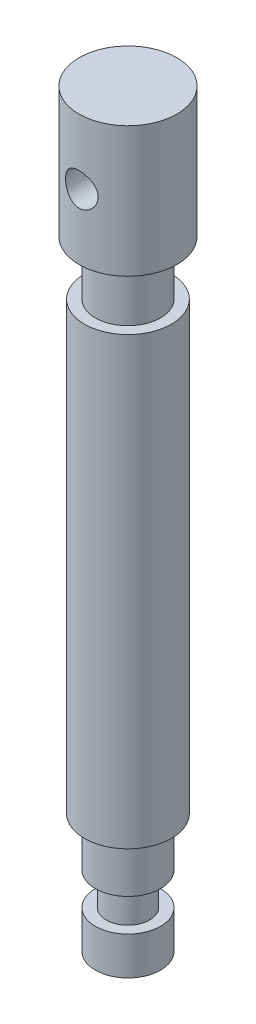
ISO-10303-21;
HEADER;
FILE_DESCRIPTION(('STEP AP214'),'2;1');
FILE_NAME('part.step','',(''),(''),'','','');
FILE_SCHEMA(('AUTOMOTIVE_DESIGN { 1 0 10303 214 1 1 1 1 }'));
ENDSEC;
DATA;
#1=APPLICATION_CONTEXT('core data for automotive mechanical design processes');
#2=APPLICATION_PROTOCOL_DEFINITION('international standard','automotive_design',2000,#1);
#3=PRODUCT_CONTEXT('',#1,'mechanical');
#4=PRODUCT('Part','Part','',(#3));
#5=PRODUCT_RELATED_PRODUCT_CATEGORY('part','',(#4));
#6=PRODUCT_DEFINITION_FORMATION('','',#4);
#7=PRODUCT_DEFINITION_CONTEXT('part definition',#1,'design');
#8=PRODUCT_DEFINITION('design','',#6,#7);
#9=PRODUCT_DEFINITION_SHAPE('','',#8);
#10=(LENGTH_UNIT() NAMED_UNIT(*) SI_UNIT(.MILLI.,.METRE.));
#11=(NAMED_UNIT(*) PLANE_ANGLE_UNIT() SI_UNIT($,.RADIAN.));
#12=(NAMED_UNIT(*) SI_UNIT($,.STERADIAN.) SOLID_ANGLE_UNIT());
#13=UNCERTAINTY_MEASURE_WITH_UNIT(LENGTH_MEASURE(1.E-05),#10,'distance_accuracy_value','');
#14=(GEOMETRIC_REPRESENTATION_CONTEXT(3) GLOBAL_UNCERTAINTY_ASSIGNED_CONTEXT((#13)) GLOBAL_UNIT_ASSIGNED_CONTEXT((#10,
#11,#12)) REPRESENTATION_CONTEXT('',''));
#15=CARTESIAN_POINT('',(0.,0.,0.));
#16=DIRECTION('',(0.,0.,1.));
#17=DIRECTION('',(1.,0.,0.));
#18=AXIS2_PLACEMENT_3D('',#15,#16,#17);
#19=CARTESIAN_POINT('',(0.,0.,0.));
#20=DIRECTION('',(0.,1.,0.));
#21=DIRECTION('',(-1.,0.,0.));
#22=AXIS2_PLACEMENT_3D('',#19,#20,#21);
#23=PLANE('',#22);
#24=CARTESIAN_POINT('',(0.,0.,0.));
#25=DIRECTION('',(0.,1.,0.));
#26=DIRECTION('',(-1.,0.,0.));
#27=AXIS2_PLACEMENT_3D('',#24,#25,#26);
#28=CIRCLE('',#27,6.);
#29=CARTESIAN_POINT('',(-6.,0.,0.));
#30=VERTEX_POINT('',#29);
#31=EDGE_CURVE('E57',#30,#30,#28,.T.);
#32=ORIENTED_EDGE('',*,*,#31,.F.);
#33=EDGE_LOOP('',(#32));
#34=FACE_BOUND('',#33,.T.);
#35=ADVANCED_FACE('F42',(#34),#23,.F.);
#36=CARTESIAN_POINT('',(0.,138.,0.));
#37=DIRECTION('',(0.,1.,0.));
#38=DIRECTION('',(-1.,0.,0.));
#39=AXIS2_PLACEMENT_3D('',#36,#37,#38);
#40=CYLINDRICAL_SURFACE('',#39,6.);
#41=CARTESIAN_POINT('',(0.,7.00000000000001,0.));
#42=DIRECTION('',(0.,1.,0.));
#43=DIRECTION('',(-1.,0.,0.));
#44=AXIS2_PLACEMENT_3D('',#41,#42,#43);
#45=CIRCLE('',#44,6.);
#46=CARTESIAN_POINT('',(-6.,7.00000000000001,0.));
#47=VERTEX_POINT('',#46);
#48=EDGE_CURVE('E61',#47,#47,#45,.T.);
#49=ORIENTED_EDGE('',*,*,#48,.F.);
#50=EDGE_LOOP('',(#49));
#51=FACE_BOUND('',#50,.T.);
#52=ORIENTED_EDGE('',*,*,#31,.T.);
#53=EDGE_LOOP('',(#52));
#54=FACE_BOUND('',#53,.T.);
#55=ADVANCED_FACE('F85',(#51,#54),#40,.T.);
#56=CARTESIAN_POINT('',(6.,7.,0.));
#57=DIRECTION('',(0.,-1.,0.));
#58=DIRECTION('',(1.,0.,0.));
#59=AXIS2_PLACEMENT_3D('',#56,#57,#58);
#60=PLANE('',#59);
#61=CARTESIAN_POINT('',(0.,7.00000000000001,0.));
#62=DIRECTION('',(0.,1.,0.));
#63=DIRECTION('',(-1.,0.,0.));
#64=AXIS2_PLACEMENT_3D('',#61,#62,#63);
#65=CIRCLE('',#64,4.00000000000002);
#66=CARTESIAN_POINT('',(-4.00000000000002,7.00000000000001,0.));
#67=VERTEX_POINT('',#66);
#68=EDGE_CURVE('E162',#67,#67,#65,.T.);
#69=ORIENTED_EDGE('',*,*,#68,.F.);
#70=EDGE_LOOP('',(#69));
#71=FACE_BOUND('',#70,.T.);
#72=ORIENTED_EDGE('',*,*,#48,.T.);
#73=EDGE_LOOP('',(#72));
#74=FACE_BOUND('',#73,.T.);
#75=ADVANCED_FACE('F90',(#71,#74),#60,.F.);
#76=CARTESIAN_POINT('',(0.,138.,0.));
#77=DIRECTION('',(0.,1.,0.));
#78=DIRECTION('',(-1.,0.,0.));
#79=AXIS2_PLACEMENT_3D('',#76,#77,#78);
#80=CYLINDRICAL_SURFACE('',#79,4.00000000000002);
#81=CARTESIAN_POINT('',(0.,13.,0.));
#82=DIRECTION('',(0.,1.,0.));
#83=DIRECTION('',(-1.,0.,0.));
#84=AXIS2_PLACEMENT_3D('',#81,#82,#83);
#85=CIRCLE('',#84,4.00000000000002);
#86=CARTESIAN_POINT('',(-4.00000000000002,13.,0.));
#87=VERTEX_POINT('',#86);
#88=EDGE_CURVE('E159',#87,#87,#85,.T.);
#89=ORIENTED_EDGE('',*,*,#88,.F.);
#90=EDGE_LOOP('',(#89));
#91=FACE_BOUND('',#90,.T.);
#92=ORIENTED_EDGE('',*,*,#68,.T.);
#93=EDGE_LOOP('',(#92));
#94=FACE_BOUND('',#93,.T.);
#95=ADVANCED_FACE('F97',(#91,#94),#80,.T.);
#96=CARTESIAN_POINT('',(4.00000000000002,13.,0.));
#97=DIRECTION('',(0.,1.,0.));
#98=DIRECTION('',(-1.,0.,0.));
#99=AXIS2_PLACEMENT_3D('',#96,#97,#98);
#100=PLANE('',#99);
#101=CARTESIAN_POINT('',(0.,13.,0.));
#102=DIRECTION('',(0.,1.,0.));
#103=DIRECTION('',(-1.,0.,0.));
#104=AXIS2_PLACEMENT_3D('',#101,#102,#103);
#105=CIRCLE('',#104,6.00000000000002);
#106=CARTESIAN_POINT('',(-6.00000000000002,13.,0.));
#107=VERTEX_POINT('',#106);
#108=EDGE_CURVE('E156',#107,#107,#105,.T.);
#109=ORIENTED_EDGE('',*,*,#108,.F.);
#110=EDGE_LOOP('',(#109));
#111=FACE_BOUND('',#110,.T.);
#112=ORIENTED_EDGE('',*,*,#88,.T.);
#113=EDGE_LOOP('',(#112));
#114=FACE_BOUND('',#113,.T.);
#115=ADVANCED_FACE('F104',(#111,#114),#100,.F.);
#116=CARTESIAN_POINT('',(0.,138.,0.));
#117=DIRECTION('',(0.,1.,0.));
#118=DIRECTION('',(-1.,0.,0.));
#119=AXIS2_PLACEMENT_3D('',#116,#117,#118);
#120=CYLINDRICAL_SURFACE('',#119,6.00000000000002);
#121=CARTESIAN_POINT('',(0.,22.,0.));
#122=DIRECTION('',(0.,1.,0.));
#123=DIRECTION('',(-1.,0.,0.));
#124=AXIS2_PLACEMENT_3D('',#121,#122,#123);
#125=CIRCLE('',#124,6.00000000000002);
#126=CARTESIAN_POINT('',(-6.00000000000002,22.,0.));
#127=VERTEX_POINT('',#126);
#128=EDGE_CURVE('E153',#127,#127,#125,.T.);
#129=ORIENTED_EDGE('',*,*,#128,.F.);
#130=EDGE_LOOP('',(#129));
#131=FACE_BOUND('',#130,.T.);
#132=ORIENTED_EDGE('',*,*,#108,.T.);
#133=EDGE_LOOP('',(#132));
#134=FACE_BOUND('',#133,.T.);
#135=ADVANCED_FACE('F108',(#131,#134),#120,.T.);
#136=CARTESIAN_POINT('',(6.00000000000002,22.,0.));
#137=DIRECTION('',(0.,1.,0.));
#138=DIRECTION('',(-1.,0.,0.));
#139=AXIS2_PLACEMENT_3D('',#136,#137,#138);
#140=PLANE('',#139);
#141=CARTESIAN_POINT('',(0.,22.,0.));
#142=DIRECTION('',(0.,1.,0.));
#143=DIRECTION('',(-1.,0.,0.));
#144=AXIS2_PLACEMENT_3D('',#141,#142,#143);
#145=CIRCLE('',#144,8.00000000000001);
#146=CARTESIAN_POINT('',(-8.00000000000002,22.,0.));
#147=VERTEX_POINT('',#146);
#148=EDGE_CURVE('E150',#147,#147,#145,.T.);
#149=ORIENTED_EDGE('',*,*,#148,.F.);
#150=EDGE_LOOP('',(#149));
#151=FACE_BOUND('',#150,.T.);
#152=ORIENTED_EDGE('',*,*,#128,.T.);
#153=EDGE_LOOP('',(#152));
#154=FACE_BOUND('',#153,.T.);
#155=ADVANCED_FACE('F112',(#151,#154),#140,.F.);
#156=CARTESIAN_POINT('',(0.,138.,0.));
#157=DIRECTION('',(0.,1.,0.));
#158=DIRECTION('',(-1.,0.,0.));
#159=AXIS2_PLACEMENT_3D('',#156,#157,#158);
#160=CYLINDRICAL_SURFACE('',#159,8.00000000000002);
#161=CARTESIAN_POINT('',(0.,104.,0.));
#162=DIRECTION('',(0.,1.,0.));
#163=DIRECTION('',(-1.,0.,0.));
#164=AXIS2_PLACEMENT_3D('',#161,#162,#163);
#165=CIRCLE('',#164,8.00000000000002);
#166=CARTESIAN_POINT('',(-8.00000000000003,104.,0.));
#167=VERTEX_POINT('',#166);
#168=EDGE_CURVE('E142',#167,#167,#165,.T.);
#169=ORIENTED_EDGE('',*,*,#168,.F.);
#170=EDGE_LOOP('',(#169));
#171=FACE_BOUND('',#170,.T.);
#172=ORIENTED_EDGE('',*,*,#148,.T.);
#173=EDGE_LOOP('',(#172));
#174=FACE_BOUND('',#173,.T.);
#175=ADVANCED_FACE('F116',(#171,#174),#160,.T.);
#176=CARTESIAN_POINT('',(8.00000000000001,104.,0.));
#177=DIRECTION('',(0.,-1.,0.));
#178=DIRECTION('',(1.,0.,0.));
#179=AXIS2_PLACEMENT_3D('',#176,#177,#178);
#180=PLANE('',#179);
#181=CARTESIAN_POINT('',(0.,104.,0.));
#182=DIRECTION('',(0.,1.,0.));
#183=DIRECTION('',(-1.,0.,0.));
#184=AXIS2_PLACEMENT_3D('',#181,#182,#183);
#185=CIRCLE('',#184,6.00000000000002);
#186=CARTESIAN_POINT('',(-6.00000000000002,104.,0.));
#187=VERTEX_POINT('',#186);
#188=EDGE_CURVE('E139',#187,#187,#185,.T.);
#189=ORIENTED_EDGE('',*,*,#188,.F.);
#190=EDGE_LOOP('',(#189));
#191=FACE_BOUND('',#190,.T.);
#192=ORIENTED_EDGE('',*,*,#168,.T.);
#193=EDGE_LOOP('',(#192));
#194=FACE_BOUND('',#193,.T.);
#195=ADVANCED_FACE('F120',(#191,#194),#180,.F.);
#196=CARTESIAN_POINT('',(0.,138.,0.));
#197=DIRECTION('',(0.,1.,0.));
#198=DIRECTION('',(-1.,0.,0.));
#199=AXIS2_PLACEMENT_3D('',#196,#197,#198);
#200=CYLINDRICAL_SURFACE('',#199,6.00000000000002);
#201=CARTESIAN_POINT('',(0.,114.,0.));
#202=DIRECTION('',(0.,1.,0.));
#203=DIRECTION('',(-1.,0.,0.));
#204=AXIS2_PLACEMENT_3D('',#201,#202,#203);
#205=CIRCLE('',#204,6.00000000000002);
#206=CARTESIAN_POINT('',(-6.00000000000002,114.,0.));
#207=VERTEX_POINT('',#206);
#208=EDGE_CURVE('E138',#207,#207,#205,.T.);
#209=ORIENTED_EDGE('',*,*,#208,.F.);
#210=EDGE_LOOP('',(#209));
#211=FACE_BOUND('',#210,.T.);
#212=ORIENTED_EDGE('',*,*,#188,.T.);
#213=EDGE_LOOP('',(#212));
#214=FACE_BOUND('',#213,.T.);
#215=ADVANCED_FACE('F124',(#211,#214),#200,.T.);
#216=CARTESIAN_POINT('',(6.00000000000001,114.,0.));
#217=DIRECTION('',(0.,1.,0.));
#218=DIRECTION('',(-1.,0.,0.));
#219=AXIS2_PLACEMENT_3D('',#216,#217,#218);
#220=PLANE('',#219);
#221=CARTESIAN_POINT('',(0.,114.,0.));
#222=DIRECTION('',(0.,1.,0.));
#223=DIRECTION('',(-1.,0.,0.));
#224=AXIS2_PLACEMENT_3D('',#221,#222,#223);
#225=CIRCLE('',#224,9.00000000000002);
#226=CARTESIAN_POINT('',(-9.00000000000002,114.,0.));
#227=VERTEX_POINT('',#226);
#228=EDGE_CURVE('E135',#227,#227,#225,.T.);
#229=ORIENTED_EDGE('',*,*,#228,.F.);
#230=EDGE_LOOP('',(#229));
#231=FACE_BOUND('',#230,.T.);
#232=ORIENTED_EDGE('',*,*,#208,.T.);
#233=EDGE_LOOP('',(#232));
#234=FACE_BOUND('',#233,.T.);
#235=ADVANCED_FACE('F82',(#231,#234),#220,.F.);
#236=CARTESIAN_POINT('',(0.,138.,0.));
#237=DIRECTION('',(0.,1.,0.));
#238=DIRECTION('',(-1.,0.,0.));
#239=AXIS2_PLACEMENT_3D('',#236,#237,#238);
#240=CYLINDRICAL_SURFACE('',#239,9.00000000000001);
#241=CARTESIAN_POINT('',(0.,129.,-9.00000000000002));
#242=CARTESIAN_POINT('',(-0.163690088660177,129.000000761195,-9.00000045902834));
#243=CARTESIAN_POINT('',(-0.327375583615656,128.986559201618,-8.99549308522636));
#244=CARTESIAN_POINT('',(-0.649925282618924,128.933312673548,-8.97795630609843));
#245=CARTESIAN_POINT('',(-0.808788984356462,128.893504968153,-8.96492601606459));
#246=CARTESIAN_POINT('',(-1.11699836850534,128.789042269848,-8.93175923719329));
#247=CARTESIAN_POINT('',(-1.26635947765811,128.724428812622,-8.91163463192561));
#248=CARTESIAN_POINT('',(-1.55212481041599,128.572376481485,-8.86633337152027));
#249=CARTESIAN_POINT('',(-1.68852647087613,128.484933104992,-8.84115572003335));
#250=CARTESIAN_POINT('',(-1.94922502506681,128.286522585424,-8.78742283329016));
#251=CARTESIAN_POINT('',(-2.07301110089493,128.174906297219,-8.75878669391356));
#252=CARTESIAN_POINT('',(-2.30049807810625,127.93269853588,-8.70180944349366));
#253=CARTESIAN_POINT('',(-2.40419455646839,127.802102895214,-8.67346839871649));
#254=CARTESIAN_POINT('',(-2.59147482668359,127.521044654411,-8.61939997431823));
#255=CARTESIAN_POINT('',(-2.67439457466311,127.370118780804,-8.59377117827066));
#256=CARTESIAN_POINT('',(-2.81345662163317,127.055471716624,-8.54925916255805));
#257=CARTESIAN_POINT('',(-2.86960709216029,126.891754448512,-8.53037388482238));
#258=CARTESIAN_POINT('',(-2.95162038452749,126.56198033551,-8.50233909808133));
#259=CARTESIAN_POINT('',(-2.97844034481531,126.396188374533,-8.49288287308835));
#260=CARTESIAN_POINT('',(-3.00402337000343,126.062208737532,-8.48386969888524));
#261=CARTESIAN_POINT('',(-3.00279510481416,125.894021817872,-8.48430969068191));
#262=CARTESIAN_POINT('',(-2.97305971111026,125.568190108668,-8.49477045024542));
#263=CARTESIAN_POINT('',(-2.94580173950098,125.410414791243,-8.50435247602601));
#264=CARTESIAN_POINT('',(-2.86681848854825,125.101819741179,-8.53129973173655));
#265=CARTESIAN_POINT('',(-2.81509027977561,124.951000843695,-8.54866589352324));
#266=CARTESIAN_POINT('',(-2.68781717418062,124.657761751226,-8.58953733393748));
#267=CARTESIAN_POINT('',(-2.61190214612178,124.515515923591,-8.61313697379354));
#268=CARTESIAN_POINT('',(-2.43866731890941,124.245387275161,-8.66377675727181));
#269=CARTESIAN_POINT('',(-2.341341337092,124.1175086192,-8.69081789371393));
#270=CARTESIAN_POINT('',(-2.1220479980467,123.872725205518,-8.74701987503224));
#271=CARTESIAN_POINT('',(-1.99905945022892,123.756741916473,-8.7762176806453));
#272=CARTESIAN_POINT('',(-1.73501870991018,123.54680620001,-8.83220815161112));
#273=CARTESIAN_POINT('',(-1.59396478698243,123.452855885507,-8.85900058614204));
#274=CARTESIAN_POINT('',(-1.29584283913879,123.288911099295,-8.90751323813382));
#275=CARTESIAN_POINT('',(-1.138629829249,123.219163525978,-8.92918050024119));
#276=CARTESIAN_POINT('',(-0.813807250093514,123.107390478133,-8.96461701433306));
#277=CARTESIAN_POINT('',(-0.646201314464852,123.06535537373,-8.97838900964639));
#278=CARTESIAN_POINT('',(-0.313151488587901,123.011833001933,-8.99602881214323));
#279=CARTESIAN_POINT('',(-0.147928799594527,122.999100572482,-9.00030005501186));
#280=CARTESIAN_POINT('',(0.182325209880726,123.000998020795,-8.99966708084484));
#281=CARTESIAN_POINT('',(0.347356557958965,123.01562327994,-8.99476441258088));
#282=CARTESIAN_POINT('',(0.667559598912782,123.070835723208,-8.97660074151314));
#283=CARTESIAN_POINT('',(0.822878420504546,123.110658618148,-8.96358596133578));
#284=CARTESIAN_POINT('',(1.12456787573873,123.2141803334,-8.93075540490211));
#285=CARTESIAN_POINT('',(1.27093736552583,123.277882198403,-8.91093876140026));
#286=CARTESIAN_POINT('',(1.55486488917983,123.429211295522,-8.8658679386187));
#287=CARTESIAN_POINT('',(1.69208987765146,123.51742377985,-8.84048444267359));
#288=CARTESIAN_POINT('',(1.95019449040678,123.71458245004,-8.78715761748788));
#289=CARTESIAN_POINT('',(2.07106910338674,123.823534968095,-8.75921350781484));
#290=CARTESIAN_POINT('',(2.29875752341891,124.06493625302,-8.70230543941335));
#291=CARTESIAN_POINT('',(2.40468290773732,124.198227680781,-8.67335283262284));
#292=CARTESIAN_POINT('',(2.59277256697073,124.481314703433,-8.61899919884127));
#293=CARTESIAN_POINT('',(2.67493664379305,124.631110435902,-8.59359820146008));
#294=CARTESIAN_POINT('',(2.81279079124909,124.94301904587,-8.54947175374151));
#295=CARTESIAN_POINT('',(2.86853439649507,125.105106237506,-8.53073282378937));
#296=CARTESIAN_POINT('',(2.95168400027807,125.437135950132,-8.5023249691935));
#297=CARTESIAN_POINT('',(2.97910276486182,125.607074896213,-8.49265195870919));
#298=CARTESIAN_POINT('',(3.00382884743203,125.940591288123,-8.48393576622533));
#299=CARTESIAN_POINT('',(3.0026107719252,126.10404702086,-8.48437200772246));
#300=CARTESIAN_POINT('',(2.97372688034608,126.428295224766,-8.49453809471603));
#301=CARTESIAN_POINT('',(2.94606263837576,126.589087853865,-8.50426738708086));
#302=CARTESIAN_POINT('',(2.86611543938803,126.900406989007,-8.53153572914676));
#303=CARTESIAN_POINT('',(2.81431003804653,127.051070475014,-8.54892294067434));
#304=CARTESIAN_POINT('',(2.68793809727923,127.341682220815,-8.58949196455407));
#305=CARTESIAN_POINT('',(2.61336650566141,127.481628093564,-8.61267506290181));
#306=CARTESIAN_POINT('',(2.43978207775028,127.753451009769,-8.6634848767814));
#307=CARTESIAN_POINT('',(2.33984472829374,127.884709505695,-8.69126134926412));
#308=CARTESIAN_POINT('',(2.11992864940694,128.129069440153,-8.7475006884976));
#309=CARTESIAN_POINT('',(1.99994425335444,128.242165727064,-8.77596374737118));
#310=CARTESIAN_POINT('',(1.73772467076207,128.451433236868,-8.83170091576634));
#311=CARTESIAN_POINT('',(1.59480454049919,128.546773043253,-8.85888545403771));
#312=CARTESIAN_POINT('',(1.29407207221987,128.711971286552,-8.90777973517837));
#313=CARTESIAN_POINT('',(1.13626355439704,128.781836237766,-8.92949087723791));
#314=CARTESIAN_POINT('',(0.817480941602916,128.891164897466,-8.96416545205627));
#315=CARTESIAN_POINT('',(0.656963273029217,128.93184739879,-8.97747637267569));
#316=CARTESIAN_POINT('',(0.330961248030734,128.986260842031,-8.99539221192667));
#317=CARTESIAN_POINT('',(0.165478276706231,128.99999923049,-8.99999953595716));
#318=CARTESIAN_POINT('',(0.,129.,-9.00000000000002));
#319=B_SPLINE_CURVE_WITH_KNOTS('',3,(#241,#242,#243,#244,#245,#246,#247,#248,#249,#250,#251,
#252,#253,#254,#255,#256,#257,#258,#259,#260,#261,#262,#263,#264,#265,#266,#267,#268,#269,#270,
#271,#272,#273,#274,#275,#276,#277,#278,#279,#280,#281,#282,#283,#284,#285,#286,#287,#288,#289,
#290,#291,#292,#293,#294,#295,#296,#297,#298,#299,#300,#301,#302,#303,#304,#305,#306,#307,#308,
#309,#310,#311,#312,#313,#314,#315,#316,#317,#318),.UNSPECIFIED.,.T.,.F.,(4,2,2,2,2,2,2,2,2,2,2,
2,2,2,2,2,2,2,2,2,2,2,2,2,2,2,2,2,2,2,2,2,2,2,2,2,2,2,4),(0.,0.49046131807803,0.980973555802565,
1.47066801861083,1.96045913339732,2.46554052848268,2.97073299862591,3.49045154470411,
4.01001134078499,4.51205777225523,5.01394901962458,5.49290479653844,5.97191792566448,
6.45864513465394,6.94551307674623,7.45779917434102,7.97013437899856,8.48755216951073,
9.00479006631626,9.4996074952551,9.99434139492531,10.4747447393464,10.9552093585231,
11.4483119953121,11.9415654246567,12.4572306864226,12.9729002470499,13.4875204148031,
14.0019085411752,14.4898699819277,14.9778023805413,15.4564676124125,15.9352391452794,
16.4349020007541,16.9347063337134,17.453989825053,17.9731404345737,18.4690967512144,
18.9649159811442),.UNSPECIFIED.);
#320=CARTESIAN_POINT('',(0.,129.,-9.00000000000002));
#321=VERTEX_POINT('',#320);
#322=EDGE_CURVE('E12',#321,#321,#319,.T.);
#323=ORIENTED_EDGE('',*,*,#322,.T.);
#324=EDGE_LOOP('',(#323));
#325=FACE_BOUND('',#324,.T.);
#326=CARTESIAN_POINT('',(3.,126.,8.48528137423858));
#327=CARTESIAN_POINT('',(3.00000077384314,125.836595475492,8.48528083591303));
#328=CARTESIAN_POINT('',(2.98660435105657,125.673195600529,8.49005307872573));
#329=CARTESIAN_POINT('',(2.93355339506643,125.351236737017,8.50852722243765));
#330=CARTESIAN_POINT('',(2.8938945365052,125.192678550383,8.52223059426567));
#331=CARTESIAN_POINT('',(2.78986645705472,124.885119321008,8.55684611066376));
#332=CARTESIAN_POINT('',(2.72554566420974,124.736100211672,8.57774411913966));
#333=CARTESIAN_POINT('',(2.57418488532415,124.450919854356,8.62437366030975));
#334=CARTESIAN_POINT('',(2.48713988658056,124.314761452339,8.65010625910838));
#335=CARTESIAN_POINT('',(2.28915343932864,124.053840112985,8.7046346822242));
#336=CARTESIAN_POINT('',(2.17747302413377,123.929653713985,8.73350684533933));
#337=CARTESIAN_POINT('',(1.9349630016432,123.701379596326,8.7904159440301));
#338=CARTESIAN_POINT('',(1.80413032515714,123.597295105253,8.81845274486886));
#339=CARTESIAN_POINT('',(1.52281352389504,123.409563308011,8.87141600765398));
#340=CARTESIAN_POINT('',(1.37190573367359,123.326520088146,8.89624223104818));
#341=CARTESIAN_POINT('',(1.05729366896244,123.187225244617,8.9390876031295));
#342=CARTESIAN_POINT('',(0.893592857061649,123.130966400469,8.95710858609007));
#343=CARTESIAN_POINT('',(0.564086452300495,123.048792436103,8.98377226295721));
#344=CARTESIAN_POINT('',(0.398552264558918,123.021889661229,8.99271944332679));
#345=CARTESIAN_POINT('',(0.0650936244722811,122.996051119918,9.00130824654745));
#346=CARTESIAN_POINT('',(-0.102830200631677,122.997108145043,9.00095226788688));
#347=CARTESIAN_POINT('',(-0.429310545581434,123.026532763698,8.99118118856195));
#348=CARTESIAN_POINT('',(-0.58797614577496,123.053827585423,8.98212194265354));
#349=CARTESIAN_POINT('',(-0.898330316466505,123.133178942941,8.95640902019196));
#350=CARTESIAN_POINT('',(-1.05001841333764,123.185237156939,8.93975482893547));
#351=CARTESIAN_POINT('',(-1.34445742452591,123.313263951918,8.90027010879674));
#352=CARTESIAN_POINT('',(-1.48706466290652,123.38953781564,8.87736127572049));
#353=CARTESIAN_POINT('',(-1.75777297658196,123.563579116346,8.82775179116759));
#354=CARTESIAN_POINT('',(-1.88587000315602,123.661352529983,8.80105008604402));
#355=CARTESIAN_POINT('',(-2.13030259965392,123.881023180379,8.74518575549691));
#356=CARTESIAN_POINT('',(-2.24580047119581,124.003839473524,8.71596645506635));
#357=CARTESIAN_POINT('',(-2.45483177879452,124.26734617718,8.65942005746704));
#358=CARTESIAN_POINT('',(-2.54836182984463,124.408039337184,8.63209325236848));
#359=CARTESIAN_POINT('',(-2.71196236510723,124.70596087681,8.58211575363339));
#360=CARTESIAN_POINT('',(-2.78167939086402,124.863396393953,8.55953727854245));
#361=CARTESIAN_POINT('',(-2.89332957980801,125.188714182643,8.52244952473156));
#362=CARTESIAN_POINT('',(-2.93527438724248,125.356592043619,8.50793686461279));
#363=CARTESIAN_POINT('',(-2.98848384629256,125.689915066235,8.48938908946757));
#364=CARTESIAN_POINT('',(-3.0010472865229,125.855128274246,8.4849108095627));
#365=CARTESIAN_POINT('',(-2.99881631672916,126.185328447342,8.48570016177555));
#366=CARTESIAN_POINT('',(-2.98402687568029,126.350315448072,8.49096602375445));
#367=CARTESIAN_POINT('',(-2.92867695465693,126.669470897136,8.510208542709));
#368=CARTESIAN_POINT('',(-2.88901918194206,126.823816290452,8.52387976322522));
#369=CARTESIAN_POINT('',(-2.78614158768141,127.123630818718,8.5580566101307));
#370=CARTESIAN_POINT('',(-2.72291758909028,127.269098374772,8.57856344804519));
#371=CARTESIAN_POINT('',(-2.57242302221683,127.552141262541,8.62490632787362));
#372=CARTESIAN_POINT('',(-2.48445335507551,127.689319927925,8.65089076996886));
#373=CARTESIAN_POINT('',(-2.28775689167269,127.947438157151,8.70497306192897));
#374=CARTESIAN_POINT('',(-2.17902397649635,128.068372915984,8.73307153331385));
#375=CARTESIAN_POINT('',(-1.93767511770098,128.296583952272,8.78985115913549));
#376=CARTESIAN_POINT('',(-1.80416181163996,128.402923170057,8.81849530733691));
#377=CARTESIAN_POINT('',(-1.52048187420078,128.591748427044,8.87180554839328));
#378=CARTESIAN_POINT('',(-1.37031583459367,128.674235313487,8.89647178253085));
#379=CARTESIAN_POINT('',(-1.05833958729691,128.812260314585,8.9389321743181));
#380=CARTESIAN_POINT('',(-0.896613369963614,128.867973831444,8.95677090013595));
#381=CARTESIAN_POINT('',(-0.565375397538073,128.95118322618,8.98375832513325));
#382=CARTESIAN_POINT('',(-0.395866475861689,128.978689289642,8.99291016102057));
#383=CARTESIAN_POINT('',(-0.0624460075801407,129.003786232817,9.0012558970877));
#384=CARTESIAN_POINT('',(0.101354171760038,129.002722361797,9.00089760268319));
#385=CARTESIAN_POINT('',(0.426333435000507,128.974028075561,8.99136589558195));
#386=CARTESIAN_POINT('',(0.587512730457158,128.946399815542,8.98219319800729));
#387=CARTESIAN_POINT('',(0.900126358296169,128.866253296272,8.95622744863238));
#388=CARTESIAN_POINT('',(1.05167481273836,128.814137353941,8.93955775083447));
#389=CARTESIAN_POINT('',(1.34393505281938,128.686867406709,8.90031482113486));
#390=CARTESIAN_POINT('',(1.48464487242729,128.611709234409,8.87774052144051));
#391=CARTESIAN_POINT('',(1.75690204892635,128.437291463694,8.82797606483644));
#392=CARTESIAN_POINT('',(1.88791875467282,128.337243943855,8.80064617475781));
#393=CARTESIAN_POINT('',(2.13174307881728,128.117227826531,8.7447896637564));
#394=CARTESIAN_POINT('',(2.24454486487377,127.997252873212,8.71626266319293));
#395=CARTESIAN_POINT('',(2.45322542649934,127.735171933239,8.65989839476796));
#396=CARTESIAN_POINT('',(2.54826889799369,127.59238346707,8.63213183965893));
#397=CARTESIAN_POINT('',(2.71294302990334,127.291996719292,8.58180579969047));
#398=CARTESIAN_POINT('',(2.78258033045842,127.134402320911,8.55924495483749));
#399=CARTESIAN_POINT('',(2.89153148461249,126.816114527953,8.52304002619545));
#400=CARTESIAN_POINT('',(2.93207372744856,126.655883209424,8.50903898571548));
#401=CARTESIAN_POINT('',(2.9863029604478,126.3304318486,8.49016150618556));
#402=CARTESIAN_POINT('',(2.99999921758978,126.165213547768,8.48528191852384));
#403=CARTESIAN_POINT('',(3.,126.,8.48528137423858));
#404=B_SPLINE_CURVE_WITH_KNOTS('',3,(#326,#327,#328,#329,#330,#331,#332,#333,#334,#335,#336,
#337,#338,#339,#340,#341,#342,#343,#344,#345,#346,#347,#348,#349,#350,#351,#352,#353,#354,#355,
#356,#357,#358,#359,#360,#361,#362,#363,#364,#365,#366,#367,#368,#369,#370,#371,#372,#373,#374,
#375,#376,#377,#378,#379,#380,#381,#382,#383,#384,#385,#386,#387,#388,#389,#390,#391,#392,#393,
#394,#395,#396,#397,#398,#399,#400,#401,#402,#403),.UNSPECIFIED.,.T.,.F.,(4,2,2,2,2,2,2,2,2,2,2,
2,2,2,2,2,2,2,2,2,2,2,2,2,2,2,2,2,2,2,2,2,2,2,2,2,2,2,4),(0.,0.489601754398035,
0.979284165045477,1.46800988250247,1.95684349855631,2.46304012282703,2.96931795515962,
3.4888051843097,4.00815229160366,4.50942956294802,5.01057759906981,5.49207014476706,
5.97359532567709,6.46144964581004,6.94943975622065,7.46040523091753,7.97144938836317,
8.48977919529164,9.00789154069848,9.50262874093317,9.99727607511701,10.4749318730633,
10.9526723744083,11.4455657320714,11.9386045698638,12.4553642451328,12.9721055627259,
13.4854137357255,13.9985364901247,14.4875425403291,14.9765089202934,15.4577086812129,
15.9389955228973,16.438065585619,16.9372951329789,17.4560670820843,17.974703348006,
18.4698963648807,18.9649184157139),.UNSPECIFIED.);
#405=CARTESIAN_POINT('',(3.,126.,8.48528137423858));
#406=VERTEX_POINT('',#405);
#407=EDGE_CURVE('E53',#406,#406,#404,.T.);
#408=ORIENTED_EDGE('',*,*,#407,.T.);
#409=EDGE_LOOP('',(#408));
#410=FACE_BOUND('',#409,.T.);
#411=CARTESIAN_POINT('',(0.,138.,0.));
#412=DIRECTION('',(0.,1.,0.));
#413=DIRECTION('',(-1.,0.,0.));
#414=AXIS2_PLACEMENT_3D('',#411,#412,#413);
#415=CIRCLE('',#414,9.00000000000001);
#416=CARTESIAN_POINT('',(-9.00000000000002,138.,0.));
#417=VERTEX_POINT('',#416);
#418=EDGE_CURVE('E144',#417,#417,#415,.T.);
#419=ORIENTED_EDGE('',*,*,#418,.F.);
#420=EDGE_LOOP('',(#419));
#421=FACE_BOUND('',#420,.T.);
#422=ORIENTED_EDGE('',*,*,#228,.T.);
#423=EDGE_LOOP('',(#422));
#424=FACE_BOUND('',#423,.T.);
#425=ADVANCED_FACE('F67',(#325,#410,#421,#424),#240,.T.);
#426=CARTESIAN_POINT('',(9.,138.,0.));
#427=DIRECTION('',(0.,-1.,0.));
#428=DIRECTION('',(1.,0.,0.));
#429=AXIS2_PLACEMENT_3D('',#426,#427,#428);
#430=PLANE('',#429);
#431=ORIENTED_EDGE('',*,*,#418,.T.);
#432=EDGE_LOOP('',(#431));
#433=FACE_BOUND('',#432,.T.);
#434=ADVANCED_FACE('F74',(#433),#430,.F.);
#435=CARTESIAN_POINT('',(0.,126.,-9.00000000000002));
#436=DIRECTION('',(0.,0.,1.));
#437=DIRECTION('',(1.,0.,0.));
#438=AXIS2_PLACEMENT_3D('',#435,#436,#437);
#439=CYLINDRICAL_SURFACE('',#438,3.);
#440=ORIENTED_EDGE('',*,*,#407,.F.);
#441=EDGE_LOOP('',(#440));
#442=FACE_BOUND('',#441,.T.);
#443=ORIENTED_EDGE('',*,*,#322,.F.);
#444=EDGE_LOOP('',(#443));
#445=FACE_BOUND('',#444,.T.);
#446=ADVANCED_FACE('F71',(#442,#445),#439,.F.);
#447=CLOSED_SHELL('',(#35,#55,#75,#95,#115,#135,#155,#175,#195,#215,#235,#425,#434,#446));
#448=MANIFOLD_SOLID_BREP('B2',#447);
#449=ADVANCED_BREP_SHAPE_REPRESENTATION('',(#18,#448),#14);
#450=SHAPE_DEFINITION_REPRESENTATION(#9,#449);
ENDSEC;
END-ISO-10303-21;
